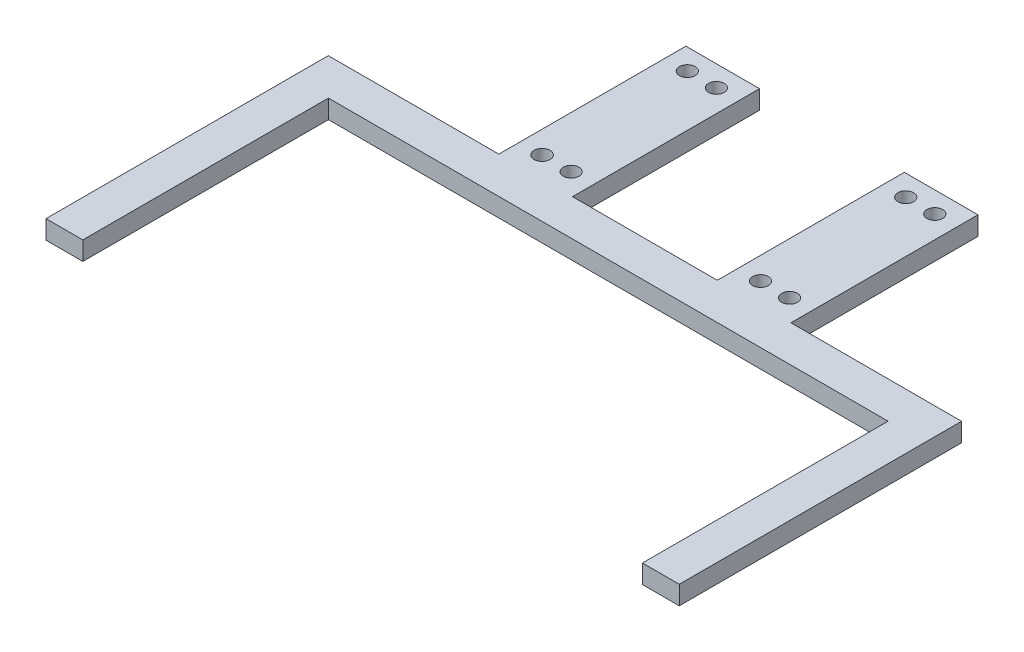
ISO-10303-21;
HEADER;
FILE_DESCRIPTION(('STEP AP214'),'2;1');
FILE_NAME('part.step','',(''),(''),'','','');
FILE_SCHEMA(('AUTOMOTIVE_DESIGN { 1 0 10303 214 1 1 1 1 }'));
ENDSEC;
DATA;
#1=APPLICATION_CONTEXT('core data for automotive mechanical design processes');
#2=APPLICATION_PROTOCOL_DEFINITION('international standard','automotive_design',2000,#1);
#3=PRODUCT_CONTEXT('',#1,'mechanical');
#4=PRODUCT('Part','Part','',(#3));
#5=PRODUCT_RELATED_PRODUCT_CATEGORY('part','',(#4));
#6=PRODUCT_DEFINITION_FORMATION('','',#4);
#7=PRODUCT_DEFINITION_CONTEXT('part definition',#1,'design');
#8=PRODUCT_DEFINITION('design','',#6,#7);
#9=PRODUCT_DEFINITION_SHAPE('','',#8);
#10=(LENGTH_UNIT() NAMED_UNIT(*) SI_UNIT(.MILLI.,.METRE.));
#11=(NAMED_UNIT(*) PLANE_ANGLE_UNIT() SI_UNIT($,.RADIAN.));
#12=(NAMED_UNIT(*) SI_UNIT($,.STERADIAN.) SOLID_ANGLE_UNIT());
#13=UNCERTAINTY_MEASURE_WITH_UNIT(LENGTH_MEASURE(1.E-05),#10,'distance_accuracy_value','');
#14=(GEOMETRIC_REPRESENTATION_CONTEXT(3) GLOBAL_UNCERTAINTY_ASSIGNED_CONTEXT((#13)) GLOBAL_UNIT_ASSIGNED_CONTEXT((#10,
#11,#12)) REPRESENTATION_CONTEXT('',''));
#15=CARTESIAN_POINT('',(0.,0.,0.));
#16=DIRECTION('',(0.,0.,1.));
#17=DIRECTION('',(1.,0.,0.));
#18=AXIS2_PLACEMENT_3D('',#15,#16,#17);
#19=CARTESIAN_POINT('',(19.2948975355751,6.35,-79.2235837449614));
#20=DIRECTION('',(0.,0.,1.));
#21=DIRECTION('',(1.,0.,0.));
#22=AXIS2_PLACEMENT_3D('',#19,#20,#21);
#23=PLANE('',#22);
#24=DIRECTION('',(-1.,0.,0.));
#25=VECTOR('',#24,1.);
#26=CARTESIAN_POINT('',(19.2948975355751,0.,-79.2235837449614));
#27=LINE('',#26,#25);
#28=CARTESIAN_POINT('',(77.2108975355751,0.,-79.2235837449614));
#29=VERTEX_POINT('',#28);
#30=CARTESIAN_POINT('',(19.2948975355751,0.,-79.2235837449614));
#31=VERTEX_POINT('',#30);
#32=EDGE_CURVE('E188',#29,#31,#27,.T.);
#33=ORIENTED_EDGE('',*,*,#32,.T.);
#34=DIRECTION('',(0.,-1.,0.));
#35=VECTOR('',#34,1.);
#36=CARTESIAN_POINT('',(19.2948975355751,6.35,-79.2235837449614));
#37=LINE('',#36,#35);
#38=CARTESIAN_POINT('',(19.2948975355751,6.35,-79.2235837449614));
#39=VERTEX_POINT('',#38);
#40=EDGE_CURVE('E11',#39,#31,#37,.T.);
#41=ORIENTED_EDGE('',*,*,#40,.F.);
#42=DIRECTION('',(-1.,0.,0.));
#43=VECTOR('',#42,1.);
#44=CARTESIAN_POINT('',(19.2948975355751,6.35,-79.2235837449614));
#45=LINE('',#44,#43);
#46=CARTESIAN_POINT('',(77.2108975355751,6.35,-79.2235837449614));
#47=VERTEX_POINT('',#46);
#48=EDGE_CURVE('E235',#47,#39,#45,.T.);
#49=ORIENTED_EDGE('',*,*,#48,.F.);
#50=DIRECTION('',(0.,-1.,0.));
#51=VECTOR('',#50,1.);
#52=CARTESIAN_POINT('',(77.2108975355751,6.35,-79.2235837449614));
#53=LINE('',#52,#51);
#54=EDGE_CURVE('E184',#47,#29,#53,.T.);
#55=ORIENTED_EDGE('',*,*,#54,.T.);
#56=EDGE_LOOP('',(#33,#41,#49,#55));
#57=FACE_BOUND('',#56,.T.);
#58=ADVANCED_FACE('F39',(#57),#23,.F.);
#59=CARTESIAN_POINT('',(19.2948975355752,6.35,16.6150405936629));
#60=DIRECTION('',(1.,0.,0.));
#61=DIRECTION('',(0.,0.,-1.));
#62=AXIS2_PLACEMENT_3D('',#59,#60,#61);
#63=PLANE('',#62);
#64=DIRECTION('',(0.,0.,1.));
#65=VECTOR('',#64,1.);
#66=CARTESIAN_POINT('',(19.2948975355752,0.,16.6150405936629));
#67=LINE('',#66,#65);
#68=CARTESIAN_POINT('',(19.2948975355752,0.,16.6150405936629));
#69=VERTEX_POINT('',#68);
#70=EDGE_CURVE('E192',#31,#69,#67,.T.);
#71=ORIENTED_EDGE('',*,*,#70,.T.);
#72=DIRECTION('',(0.,-1.,0.));
#73=VECTOR('',#72,1.);
#74=CARTESIAN_POINT('',(19.2948975355752,6.35,16.6150405936629));
#75=LINE('',#74,#73);
#76=CARTESIAN_POINT('',(19.2948975355752,6.35,16.6150405936629));
#77=VERTEX_POINT('',#76);
#78=EDGE_CURVE('E48',#77,#69,#75,.T.);
#79=ORIENTED_EDGE('',*,*,#78,.F.);
#80=DIRECTION('',(0.,0.,1.));
#81=VECTOR('',#80,1.);
#82=CARTESIAN_POINT('',(19.2948975355752,6.35,16.6150405936629));
#83=LINE('',#82,#81);
#84=EDGE_CURVE('E123',#39,#77,#83,.T.);
#85=ORIENTED_EDGE('',*,*,#84,.F.);
#86=ORIENTED_EDGE('',*,*,#40,.T.);
#87=EDGE_LOOP('',(#71,#79,#85,#86));
#88=FACE_BOUND('',#87,.T.);
#89=ADVANCED_FACE('F358',(#88),#63,.F.);
#90=CARTESIAN_POINT('',(31.7948975355752,6.35,16.6150405936629));
#91=DIRECTION('',(0.,0.,-1.));
#92=DIRECTION('',(-1.,0.,0.));
#93=AXIS2_PLACEMENT_3D('',#90,#91,#92);
#94=PLANE('',#93);
#95=DIRECTION('',(1.,0.,0.));
#96=VECTOR('',#95,1.);
#97=CARTESIAN_POINT('',(31.7948975355752,0.,16.6150405936629));
#98=LINE('',#97,#96);
#99=CARTESIAN_POINT('',(31.7948975355752,0.,16.6150405936629));
#100=VERTEX_POINT('',#99);
#101=EDGE_CURVE('E196',#69,#100,#98,.T.);
#102=ORIENTED_EDGE('',*,*,#101,.T.);
#103=DIRECTION('',(0.,-1.,0.));
#104=VECTOR('',#103,1.);
#105=CARTESIAN_POINT('',(31.7948975355752,6.35,16.6150405936629));
#106=LINE('',#105,#104);
#107=CARTESIAN_POINT('',(31.7948975355752,6.35,16.6150405936629));
#108=VERTEX_POINT('',#107);
#109=EDGE_CURVE('E278',#108,#100,#106,.T.);
#110=ORIENTED_EDGE('',*,*,#109,.F.);
#111=DIRECTION('',(1.,0.,0.));
#112=VECTOR('',#111,1.);
#113=CARTESIAN_POINT('',(31.7948975355752,6.35,16.6150405936629));
#114=LINE('',#113,#112);
#115=EDGE_CURVE('E288',#77,#108,#114,.T.);
#116=ORIENTED_EDGE('',*,*,#115,.F.);
#117=ORIENTED_EDGE('',*,*,#78,.T.);
#118=EDGE_LOOP('',(#102,#110,#116,#117));
#119=FACE_BOUND('',#118,.T.);
#120=ADVANCED_FACE('F286',(#119),#94,.F.);
#121=CARTESIAN_POINT('',(31.7948975355751,6.35,-66.7775837449614));
#122=DIRECTION('',(-1.,0.,0.));
#123=DIRECTION('',(0.,0.,1.));
#124=AXIS2_PLACEMENT_3D('',#121,#122,#123);
#125=PLANE('',#124);
#126=DIRECTION('',(0.,0.,-1.));
#127=VECTOR('',#126,1.);
#128=CARTESIAN_POINT('',(31.7948975355751,0.,-66.7775837449614));
#129=LINE('',#128,#127);
#130=CARTESIAN_POINT('',(31.7948975355751,0.,-66.7775837449614));
#131=VERTEX_POINT('',#130);
#132=EDGE_CURVE('E199',#100,#131,#129,.T.);
#133=ORIENTED_EDGE('',*,*,#132,.T.);
#134=DIRECTION('',(0.,-1.,0.));
#135=VECTOR('',#134,1.);
#136=CARTESIAN_POINT('',(31.7948975355751,6.35,-66.7775837449614));
#137=LINE('',#136,#135);
#138=CARTESIAN_POINT('',(31.7948975355751,6.35,-66.7775837449614));
#139=VERTEX_POINT('',#138);
#140=EDGE_CURVE('E274',#139,#131,#137,.T.);
#141=ORIENTED_EDGE('',*,*,#140,.F.);
#142=DIRECTION('',(0.,0.,-1.));
#143=VECTOR('',#142,1.);
#144=CARTESIAN_POINT('',(31.7948975355751,6.35,-66.7775837449614));
#145=LINE('',#144,#143);
#146=EDGE_CURVE('E307',#108,#139,#145,.T.);
#147=ORIENTED_EDGE('',*,*,#146,.F.);
#148=ORIENTED_EDGE('',*,*,#109,.T.);
#149=EDGE_LOOP('',(#133,#141,#147,#148));
#150=FACE_BOUND('',#149,.T.);
#151=ADVANCED_FACE('F297',(#150),#125,.F.);
#152=CARTESIAN_POINT('',(221.794897535575,6.35,-66.7775837449614));
#153=DIRECTION('',(0.,0.,-1.));
#154=DIRECTION('',(-1.,0.,0.));
#155=AXIS2_PLACEMENT_3D('',#152,#153,#154);
#156=PLANE('',#155);
#157=DIRECTION('',(1.,0.,0.));
#158=VECTOR('',#157,1.);
#159=CARTESIAN_POINT('',(221.794897535575,0.,-66.7775837449614));
#160=LINE('',#159,#158);
#161=CARTESIAN_POINT('',(221.794897535575,0.,-66.7775837449614));
#162=VERTEX_POINT('',#161);
#163=EDGE_CURVE('E202',#131,#162,#160,.T.);
#164=ORIENTED_EDGE('',*,*,#163,.T.);
#165=DIRECTION('',(0.,-1.,0.));
#166=VECTOR('',#165,1.);
#167=CARTESIAN_POINT('',(221.794897535575,6.35,-66.7775837449614));
#168=LINE('',#167,#166);
#169=CARTESIAN_POINT('',(221.794897535575,6.35,-66.7775837449614));
#170=VERTEX_POINT('',#169);
#171=EDGE_CURVE('E270',#170,#162,#168,.T.);
#172=ORIENTED_EDGE('',*,*,#171,.F.);
#173=DIRECTION('',(1.,0.,0.));
#174=VECTOR('',#173,1.);
#175=CARTESIAN_POINT('',(221.794897535575,6.35,-66.7775837449614));
#176=LINE('',#175,#174);
#177=EDGE_CURVE('E303',#139,#170,#176,.T.);
#178=ORIENTED_EDGE('',*,*,#177,.F.);
#179=ORIENTED_EDGE('',*,*,#140,.T.);
#180=EDGE_LOOP('',(#164,#172,#178,#179));
#181=FACE_BOUND('',#180,.T.);
#182=ADVANCED_FACE('F301',(#181),#156,.F.);
#183=CARTESIAN_POINT('',(221.794897535575,6.35,16.6150405936629));
#184=DIRECTION('',(1.,0.,0.));
#185=DIRECTION('',(0.,0.,-1.));
#186=AXIS2_PLACEMENT_3D('',#183,#184,#185);
#187=PLANE('',#186);
#188=DIRECTION('',(0.,0.,1.));
#189=VECTOR('',#188,1.);
#190=CARTESIAN_POINT('',(221.794897535575,0.,16.6150405936629));
#191=LINE('',#190,#189);
#192=CARTESIAN_POINT('',(221.794897535575,0.,16.6150405936629));
#193=VERTEX_POINT('',#192);
#194=EDGE_CURVE('E205',#162,#193,#191,.T.);
#195=ORIENTED_EDGE('',*,*,#194,.T.);
#196=DIRECTION('',(0.,-1.,0.));
#197=VECTOR('',#196,1.);
#198=CARTESIAN_POINT('',(221.794897535575,6.35,16.6150405936629));
#199=LINE('',#198,#197);
#200=CARTESIAN_POINT('',(221.794897535575,6.35,16.6150405936629));
#201=VERTEX_POINT('',#200);
#202=EDGE_CURVE('E266',#201,#193,#199,.T.);
#203=ORIENTED_EDGE('',*,*,#202,.F.);
#204=DIRECTION('',(0.,0.,1.));
#205=VECTOR('',#204,1.);
#206=CARTESIAN_POINT('',(221.794897535575,6.35,16.6150405936629));
#207=LINE('',#206,#205);
#208=EDGE_CURVE('E306',#170,#201,#207,.T.);
#209=ORIENTED_EDGE('',*,*,#208,.F.);
#210=ORIENTED_EDGE('',*,*,#171,.T.);
#211=EDGE_LOOP('',(#195,#203,#209,#210));
#212=FACE_BOUND('',#211,.T.);
#213=ADVANCED_FACE('F371',(#212),#187,.F.);
#214=CARTESIAN_POINT('',(234.294897535575,6.35,16.6150405936629));
#215=DIRECTION('',(0.,0.,-1.));
#216=DIRECTION('',(-1.,0.,0.));
#217=AXIS2_PLACEMENT_3D('',#214,#215,#216);
#218=PLANE('',#217);
#219=DIRECTION('',(1.,0.,0.));
#220=VECTOR('',#219,1.);
#221=CARTESIAN_POINT('',(234.294897535575,0.,16.6150405936629));
#222=LINE('',#221,#220);
#223=CARTESIAN_POINT('',(234.294897535575,0.,16.6150405936629));
#224=VERTEX_POINT('',#223);
#225=EDGE_CURVE('E208',#193,#224,#222,.T.);
#226=ORIENTED_EDGE('',*,*,#225,.T.);
#227=DIRECTION('',(0.,-1.,0.));
#228=VECTOR('',#227,1.);
#229=CARTESIAN_POINT('',(234.294897535575,6.35,16.6150405936629));
#230=LINE('',#229,#228);
#231=CARTESIAN_POINT('',(234.294897535575,6.35,16.6150405936629));
#232=VERTEX_POINT('',#231);
#233=EDGE_CURVE('E262',#232,#224,#230,.T.);
#234=ORIENTED_EDGE('',*,*,#233,.F.);
#235=DIRECTION('',(1.,0.,0.));
#236=VECTOR('',#235,1.);
#237=CARTESIAN_POINT('',(234.294897535575,6.35,16.6150405936629));
#238=LINE('',#237,#236);
#239=EDGE_CURVE('E311',#201,#232,#238,.T.);
#240=ORIENTED_EDGE('',*,*,#239,.F.);
#241=ORIENTED_EDGE('',*,*,#202,.T.);
#242=EDGE_LOOP('',(#226,#234,#240,#241));
#243=FACE_BOUND('',#242,.T.);
#244=ADVANCED_FACE('F374',(#243),#218,.F.);
#245=CARTESIAN_POINT('',(234.294897535575,6.35,-79.2235837449614));
#246=DIRECTION('',(-1.,0.,0.));
#247=DIRECTION('',(0.,0.,1.));
#248=AXIS2_PLACEMENT_3D('',#245,#246,#247);
#249=PLANE('',#248);
#250=DIRECTION('',(0.,0.,-1.));
#251=VECTOR('',#250,1.);
#252=CARTESIAN_POINT('',(234.294897535575,0.,-79.2235837449614));
#253=LINE('',#252,#251);
#254=CARTESIAN_POINT('',(234.294897535575,0.,-79.2235837449614));
#255=VERTEX_POINT('',#254);
#256=EDGE_CURVE('E211',#224,#255,#253,.T.);
#257=ORIENTED_EDGE('',*,*,#256,.T.);
#258=DIRECTION('',(0.,-1.,0.));
#259=VECTOR('',#258,1.);
#260=CARTESIAN_POINT('',(234.294897535575,6.35,-79.2235837449614));
#261=LINE('',#260,#259);
#262=CARTESIAN_POINT('',(234.294897535575,6.35,-79.2235837449614));
#263=VERTEX_POINT('',#262);
#264=EDGE_CURVE('E258',#263,#255,#261,.T.);
#265=ORIENTED_EDGE('',*,*,#264,.F.);
#266=DIRECTION('',(0.,0.,-1.));
#267=VECTOR('',#266,1.);
#268=CARTESIAN_POINT('',(234.294897535575,6.35,-79.2235837449614));
#269=LINE('',#268,#267);
#270=EDGE_CURVE('E318',#232,#263,#269,.T.);
#271=ORIENTED_EDGE('',*,*,#270,.F.);
#272=ORIENTED_EDGE('',*,*,#233,.T.);
#273=EDGE_LOOP('',(#257,#265,#271,#272));
#274=FACE_BOUND('',#273,.T.);
#275=ADVANCED_FACE('F378',(#274),#249,.F.);
#276=CARTESIAN_POINT('',(176.378897535575,6.35,-79.2235837449614));
#277=DIRECTION('',(0.,0.,1.));
#278=DIRECTION('',(1.,0.,0.));
#279=AXIS2_PLACEMENT_3D('',#276,#277,#278);
#280=PLANE('',#279);
#281=DIRECTION('',(-1.,0.,0.));
#282=VECTOR('',#281,1.);
#283=CARTESIAN_POINT('',(176.378897535575,0.,-79.2235837449614));
#284=LINE('',#283,#282);
#285=CARTESIAN_POINT('',(176.378897535575,0.,-79.2235837449614));
#286=VERTEX_POINT('',#285);
#287=EDGE_CURVE('E214',#255,#286,#284,.T.);
#288=ORIENTED_EDGE('',*,*,#287,.T.);
#289=DIRECTION('',(0.,-1.,0.));
#290=VECTOR('',#289,1.);
#291=CARTESIAN_POINT('',(176.378897535575,6.35,-79.2235837449614));
#292=LINE('',#291,#290);
#293=CARTESIAN_POINT('',(176.378897535575,6.35,-79.2235837449614));
#294=VERTEX_POINT('',#293);
#295=EDGE_CURVE('E254',#294,#286,#292,.T.);
#296=ORIENTED_EDGE('',*,*,#295,.F.);
#297=DIRECTION('',(-1.,0.,0.));
#298=VECTOR('',#297,1.);
#299=CARTESIAN_POINT('',(176.378897535575,6.35,-79.2235837449614));
#300=LINE('',#299,#298);
#301=EDGE_CURVE('E321',#263,#294,#300,.T.);
#302=ORIENTED_EDGE('',*,*,#301,.F.);
#303=ORIENTED_EDGE('',*,*,#264,.T.);
#304=EDGE_LOOP('',(#288,#296,#302,#303));
#305=FACE_BOUND('',#304,.T.);
#306=ADVANCED_FACE('F382',(#305),#280,.F.);
#307=CARTESIAN_POINT('',(176.378897535575,6.35,-142.723583744961));
#308=DIRECTION('',(-1.,0.,0.));
#309=DIRECTION('',(0.,0.,1.));
#310=AXIS2_PLACEMENT_3D('',#307,#308,#309);
#311=PLANE('',#310);
#312=DIRECTION('',(0.,0.,-1.));
#313=VECTOR('',#312,1.);
#314=CARTESIAN_POINT('',(176.378897535575,0.,-142.723583744961));
#315=LINE('',#314,#313);
#316=CARTESIAN_POINT('',(176.378897535575,0.,-142.723583744961));
#317=VERTEX_POINT('',#316);
#318=EDGE_CURVE('E217',#286,#317,#315,.T.);
#319=ORIENTED_EDGE('',*,*,#318,.T.);
#320=DIRECTION('',(0.,-1.,0.));
#321=VECTOR('',#320,1.);
#322=CARTESIAN_POINT('',(176.378897535575,6.35,-142.723583744961));
#323=LINE('',#322,#321);
#324=CARTESIAN_POINT('',(176.378897535575,6.35,-142.723583744961));
#325=VERTEX_POINT('',#324);
#326=EDGE_CURVE('E250',#325,#317,#323,.T.);
#327=ORIENTED_EDGE('',*,*,#326,.F.);
#328=DIRECTION('',(0.,0.,-1.));
#329=VECTOR('',#328,1.);
#330=CARTESIAN_POINT('',(176.378897535575,6.35,-142.723583744961));
#331=LINE('',#330,#329);
#332=EDGE_CURVE('E324',#294,#325,#331,.T.);
#333=ORIENTED_EDGE('',*,*,#332,.F.);
#334=ORIENTED_EDGE('',*,*,#295,.T.);
#335=EDGE_LOOP('',(#319,#327,#333,#334));
#336=FACE_BOUND('',#335,.T.);
#337=ADVANCED_FACE('F386',(#336),#311,.F.);
#338=CARTESIAN_POINT('',(151.378897535575,6.35,-142.723583744961));
#339=DIRECTION('',(0.,0.,1.));
#340=DIRECTION('',(1.,0.,0.));
#341=AXIS2_PLACEMENT_3D('',#338,#339,#340);
#342=PLANE('',#341);
#343=DIRECTION('',(-1.,0.,0.));
#344=VECTOR('',#343,1.);
#345=CARTESIAN_POINT('',(151.378897535575,0.,-142.723583744961));
#346=LINE('',#345,#344);
#347=CARTESIAN_POINT('',(151.378897535575,0.,-142.723583744961));
#348=VERTEX_POINT('',#347);
#349=EDGE_CURVE('E220',#317,#348,#346,.T.);
#350=ORIENTED_EDGE('',*,*,#349,.T.);
#351=DIRECTION('',(0.,-1.,0.));
#352=VECTOR('',#351,1.);
#353=CARTESIAN_POINT('',(151.378897535575,6.35,-142.723583744961));
#354=LINE('',#353,#352);
#355=CARTESIAN_POINT('',(151.378897535575,6.35,-142.723583744961));
#356=VERTEX_POINT('',#355);
#357=EDGE_CURVE('E246',#356,#348,#354,.T.);
#358=ORIENTED_EDGE('',*,*,#357,.F.);
#359=DIRECTION('',(-1.,0.,0.));
#360=VECTOR('',#359,1.);
#361=CARTESIAN_POINT('',(151.378897535575,6.35,-142.723583744961));
#362=LINE('',#361,#360);
#363=EDGE_CURVE('E327',#325,#356,#362,.T.);
#364=ORIENTED_EDGE('',*,*,#363,.F.);
#365=ORIENTED_EDGE('',*,*,#326,.T.);
#366=EDGE_LOOP('',(#350,#358,#364,#365));
#367=FACE_BOUND('',#366,.T.);
#368=ADVANCED_FACE('F390',(#367),#342,.F.);
#369=CARTESIAN_POINT('',(151.378897535575,6.35,-79.2235837449614));
#370=DIRECTION('',(1.,0.,0.));
#371=DIRECTION('',(0.,0.,-1.));
#372=AXIS2_PLACEMENT_3D('',#369,#370,#371);
#373=PLANE('',#372);
#374=DIRECTION('',(0.,0.,1.));
#375=VECTOR('',#374,1.);
#376=CARTESIAN_POINT('',(151.378897535575,0.,-79.2235837449614));
#377=LINE('',#376,#375);
#378=CARTESIAN_POINT('',(151.378897535575,0.,-79.2235837449614));
#379=VERTEX_POINT('',#378);
#380=EDGE_CURVE('E223',#348,#379,#377,.T.);
#381=ORIENTED_EDGE('',*,*,#380,.T.);
#382=DIRECTION('',(0.,-1.,0.));
#383=VECTOR('',#382,1.);
#384=CARTESIAN_POINT('',(151.378897535575,6.35,-79.2235837449614));
#385=LINE('',#384,#383);
#386=CARTESIAN_POINT('',(151.378897535575,6.35,-79.2235837449614));
#387=VERTEX_POINT('',#386);
#388=EDGE_CURVE('E242',#387,#379,#385,.T.);
#389=ORIENTED_EDGE('',*,*,#388,.F.);
#390=DIRECTION('',(0.,0.,1.));
#391=VECTOR('',#390,1.);
#392=CARTESIAN_POINT('',(151.378897535575,6.35,-79.2235837449614));
#393=LINE('',#392,#391);
#394=EDGE_CURVE('E330',#356,#387,#393,.T.);
#395=ORIENTED_EDGE('',*,*,#394,.F.);
#396=ORIENTED_EDGE('',*,*,#357,.T.);
#397=EDGE_LOOP('',(#381,#389,#395,#396));
#398=FACE_BOUND('',#397,.T.);
#399=ADVANCED_FACE('F338',(#398),#373,.F.);
#400=CARTESIAN_POINT('',(102.210897535575,6.35,-79.2235837449614));
#401=DIRECTION('',(0.,0.,1.));
#402=DIRECTION('',(1.,0.,0.));
#403=AXIS2_PLACEMENT_3D('',#400,#401,#402);
#404=PLANE('',#403);
#405=DIRECTION('',(-1.,0.,0.));
#406=VECTOR('',#405,1.);
#407=CARTESIAN_POINT('',(102.210897535575,0.,-79.2235837449614));
#408=LINE('',#407,#406);
#409=CARTESIAN_POINT('',(102.210897535575,0.,-79.2235837449614));
#410=VERTEX_POINT('',#409);
#411=EDGE_CURVE('E226',#379,#410,#408,.T.);
#412=ORIENTED_EDGE('',*,*,#411,.T.);
#413=DIRECTION('',(0.,-1.,0.));
#414=VECTOR('',#413,1.);
#415=CARTESIAN_POINT('',(102.210897535575,6.35,-79.2235837449614));
#416=LINE('',#415,#414);
#417=CARTESIAN_POINT('',(102.210897535575,6.35,-79.2235837449614));
#418=VERTEX_POINT('',#417);
#419=EDGE_CURVE('E177',#418,#410,#416,.T.);
#420=ORIENTED_EDGE('',*,*,#419,.F.);
#421=DIRECTION('',(-1.,0.,0.));
#422=VECTOR('',#421,1.);
#423=CARTESIAN_POINT('',(102.210897535575,6.35,-79.2235837449614));
#424=LINE('',#423,#422);
#425=EDGE_CURVE('E166',#387,#418,#424,.T.);
#426=ORIENTED_EDGE('',*,*,#425,.F.);
#427=ORIENTED_EDGE('',*,*,#388,.T.);
#428=EDGE_LOOP('',(#412,#420,#426,#427));
#429=FACE_BOUND('',#428,.T.);
#430=ADVANCED_FACE('F342',(#429),#404,.F.);
#431=CARTESIAN_POINT('',(102.210897535575,6.35,-142.723583744961));
#432=DIRECTION('',(-1.,0.,0.));
#433=DIRECTION('',(0.,0.,1.));
#434=AXIS2_PLACEMENT_3D('',#431,#432,#433);
#435=PLANE('',#434);
#436=DIRECTION('',(0.,0.,-1.));
#437=VECTOR('',#436,1.);
#438=CARTESIAN_POINT('',(102.210897535575,0.,-142.723583744961));
#439=LINE('',#438,#437);
#440=CARTESIAN_POINT('',(102.210897535575,0.,-142.723583744961));
#441=VERTEX_POINT('',#440);
#442=EDGE_CURVE('E175',#410,#441,#439,.T.);
#443=ORIENTED_EDGE('',*,*,#442,.T.);
#444=DIRECTION('',(0.,-1.,0.));
#445=VECTOR('',#444,1.);
#446=CARTESIAN_POINT('',(102.210897535575,6.35,-142.723583744961));
#447=LINE('',#446,#445);
#448=CARTESIAN_POINT('',(102.210897535575,6.35,-142.723583744961));
#449=VERTEX_POINT('',#448);
#450=EDGE_CURVE('E172',#449,#441,#447,.T.);
#451=ORIENTED_EDGE('',*,*,#450,.F.);
#452=DIRECTION('',(0.,0.,-1.));
#453=VECTOR('',#452,1.);
#454=CARTESIAN_POINT('',(102.210897535575,6.35,-142.723583744961));
#455=LINE('',#454,#453);
#456=EDGE_CURVE('E160',#418,#449,#455,.T.);
#457=ORIENTED_EDGE('',*,*,#456,.F.);
#458=ORIENTED_EDGE('',*,*,#419,.T.);
#459=EDGE_LOOP('',(#443,#451,#457,#458));
#460=FACE_BOUND('',#459,.T.);
#461=ADVANCED_FACE('F173',(#460),#435,.F.);
#462=CARTESIAN_POINT('',(77.2108975355752,6.35,-142.723583744961));
#463=DIRECTION('',(0.,0.,1.));
#464=DIRECTION('',(1.,0.,0.));
#465=AXIS2_PLACEMENT_3D('',#462,#463,#464);
#466=PLANE('',#465);
#467=DIRECTION('',(-1.,0.,0.));
#468=VECTOR('',#467,1.);
#469=CARTESIAN_POINT('',(77.2108975355752,0.,-142.723583744961));
#470=LINE('',#469,#468);
#471=CARTESIAN_POINT('',(77.2108975355752,0.,-142.723583744961));
#472=VERTEX_POINT('',#471);
#473=EDGE_CURVE('E109',#441,#472,#470,.T.);
#474=ORIENTED_EDGE('',*,*,#473,.T.);
#475=DIRECTION('',(0.,-1.,0.));
#476=VECTOR('',#475,1.);
#477=CARTESIAN_POINT('',(77.2108975355752,6.35,-142.723583744961));
#478=LINE('',#477,#476);
#479=CARTESIAN_POINT('',(77.2108975355752,6.35,-142.723583744961));
#480=VERTEX_POINT('',#479);
#481=EDGE_CURVE('E178',#480,#472,#478,.T.);
#482=ORIENTED_EDGE('',*,*,#481,.F.);
#483=DIRECTION('',(-1.,0.,0.));
#484=VECTOR('',#483,1.);
#485=CARTESIAN_POINT('',(77.2108975355752,6.35,-142.723583744961));
#486=LINE('',#485,#484);
#487=EDGE_CURVE('E164',#449,#480,#486,.T.);
#488=ORIENTED_EDGE('',*,*,#487,.F.);
#489=ORIENTED_EDGE('',*,*,#450,.T.);
#490=EDGE_LOOP('',(#474,#482,#488,#489));
#491=FACE_BOUND('',#490,.T.);
#492=ADVANCED_FACE('F180',(#491),#466,.F.);
#493=CARTESIAN_POINT('',(77.2108975355751,6.35,-79.2235837449614));
#494=DIRECTION('',(1.,0.,0.));
#495=DIRECTION('',(0.,0.,-1.));
#496=AXIS2_PLACEMENT_3D('',#493,#494,#495);
#497=PLANE('',#496);
#498=DIRECTION('',(0.,0.,1.));
#499=VECTOR('',#498,1.);
#500=CARTESIAN_POINT('',(77.2108975355751,0.,-79.2235837449614));
#501=LINE('',#500,#499);
#502=EDGE_CURVE('E115',#472,#29,#501,.T.);
#503=ORIENTED_EDGE('',*,*,#502,.T.);
#504=ORIENTED_EDGE('',*,*,#54,.F.);
#505=DIRECTION('',(0.,0.,1.));
#506=VECTOR('',#505,1.);
#507=CARTESIAN_POINT('',(77.2108975355751,6.35,-79.2235837449614));
#508=LINE('',#507,#506);
#509=EDGE_CURVE('E56',#480,#47,#508,.T.);
#510=ORIENTED_EDGE('',*,*,#509,.F.);
#511=ORIENTED_EDGE('',*,*,#481,.T.);
#512=EDGE_LOOP('',(#503,#504,#510,#511));
#513=FACE_BOUND('',#512,.T.);
#514=ADVANCED_FACE('F346',(#513),#497,.F.);
#515=CARTESIAN_POINT('',(0.,6.35,0.));
#516=DIRECTION('',(0.,1.,0.));
#517=DIRECTION('',(0.,0.,1.));
#518=AXIS2_PLACEMENT_3D('',#515,#516,#517);
#519=PLANE('',#518);
#520=CARTESIAN_POINT('',(158.939897535575,6.35,-86.3235837449614));
#521=DIRECTION('',(0.,1.,0.));
#522=DIRECTION('',(0.,0.,1.));
#523=AXIS2_PLACEMENT_3D('',#520,#521,#522);
#524=CIRCLE('',#523,2.66300000000001);
#525=CARTESIAN_POINT('',(158.939897535575,6.35,-83.6605837449613));
#526=VERTEX_POINT('',#525);
#527=EDGE_CURVE('E516',#526,#526,#524,.F.);
#528=ORIENTED_EDGE('',*,*,#527,.T.);
#529=EDGE_LOOP('',(#528));
#530=FACE_BOUND('',#529,.T.);
#531=CARTESIAN_POINT('',(94.6498975354991,6.35,-135.623583744961));
#532=DIRECTION('',(0.,1.,0.));
#533=DIRECTION('',(0.,0.,1.));
#534=AXIS2_PLACEMENT_3D('',#531,#532,#533);
#535=CIRCLE('',#534,2.663);
#536=CARTESIAN_POINT('',(94.6498975354991,6.35,-132.960583744961));
#537=VERTEX_POINT('',#536);
#538=EDGE_CURVE('E523',#537,#537,#535,.F.);
#539=ORIENTED_EDGE('',*,*,#538,.T.);
#540=EDGE_LOOP('',(#539));
#541=FACE_BOUND('',#540,.T.);
#542=CARTESIAN_POINT('',(84.7798975354991,6.35,-135.623583744961));
#543=DIRECTION('',(0.,1.,0.));
#544=DIRECTION('',(0.,0.,1.));
#545=AXIS2_PLACEMENT_3D('',#542,#543,#544);
#546=CIRCLE('',#545,2.663);
#547=CARTESIAN_POINT('',(84.7798975354991,6.35,-132.960583744961));
#548=VERTEX_POINT('',#547);
#549=EDGE_CURVE('E534',#548,#548,#546,.F.);
#550=ORIENTED_EDGE('',*,*,#549,.T.);
#551=EDGE_LOOP('',(#550));
#552=FACE_BOUND('',#551,.T.);
#553=CARTESIAN_POINT('',(94.6498975354991,6.35,-86.3235837449614));
#554=DIRECTION('',(0.,1.,0.));
#555=DIRECTION('',(0.,0.,1.));
#556=AXIS2_PLACEMENT_3D('',#553,#554,#555);
#557=CIRCLE('',#556,2.66299999999999);
#558=CARTESIAN_POINT('',(94.6498975354991,6.35,-83.6605837449614));
#559=VERTEX_POINT('',#558);
#560=EDGE_CURVE('E533',#559,#559,#557,.F.);
#561=ORIENTED_EDGE('',*,*,#560,.T.);
#562=EDGE_LOOP('',(#561));
#563=FACE_BOUND('',#562,.T.);
#564=CARTESIAN_POINT('',(168.809897535575,6.35,-135.623583744961));
#565=DIRECTION('',(0.,1.,0.));
#566=DIRECTION('',(0.,0.,1.));
#567=AXIS2_PLACEMENT_3D('',#564,#565,#566);
#568=CIRCLE('',#567,2.66300000000001);
#569=CARTESIAN_POINT('',(168.809897535575,6.35,-132.960583744961));
#570=VERTEX_POINT('',#569);
#571=EDGE_CURVE('E570',#570,#570,#568,.F.);
#572=ORIENTED_EDGE('',*,*,#571,.T.);
#573=EDGE_LOOP('',(#572));
#574=FACE_BOUND('',#573,.T.);
#575=CARTESIAN_POINT('',(158.939897535575,6.35,-135.623583744961));
#576=DIRECTION('',(0.,1.,0.));
#577=DIRECTION('',(0.,0.,1.));
#578=AXIS2_PLACEMENT_3D('',#575,#576,#577);
#579=CIRCLE('',#578,2.66300000000001);
#580=CARTESIAN_POINT('',(158.939897535575,6.35,-132.960583744961));
#581=VERTEX_POINT('',#580);
#582=EDGE_CURVE('E561',#581,#581,#579,.F.);
#583=ORIENTED_EDGE('',*,*,#582,.T.);
#584=EDGE_LOOP('',(#583));
#585=FACE_BOUND('',#584,.T.);
#586=CARTESIAN_POINT('',(168.809897535575,6.35,-86.3235837449614));
#587=DIRECTION('',(0.,1.,0.));
#588=DIRECTION('',(0.,0.,1.));
#589=AXIS2_PLACEMENT_3D('',#586,#587,#588);
#590=CIRCLE('',#589,2.66300000000001);
#591=CARTESIAN_POINT('',(168.809897535575,6.35,-83.6605837449613));
#592=VERTEX_POINT('',#591);
#593=EDGE_CURVE('E525',#592,#592,#590,.F.);
#594=ORIENTED_EDGE('',*,*,#593,.T.);
#595=EDGE_LOOP('',(#594));
#596=FACE_BOUND('',#595,.T.);
#597=CARTESIAN_POINT('',(84.7798975354991,6.35,-86.3235837449614));
#598=DIRECTION('',(0.,1.,0.));
#599=DIRECTION('',(0.,0.,1.));
#600=AXIS2_PLACEMENT_3D('',#597,#598,#599);
#601=CIRCLE('',#600,2.71300002700001);
#602=CARTESIAN_POINT('',(84.7798975354991,6.35,-83.6105837179613));
#603=VERTEX_POINT('',#602);
#604=EDGE_CURVE('E193',#603,#603,#601,.F.);
#605=ORIENTED_EDGE('',*,*,#604,.T.);
#606=EDGE_LOOP('',(#605));
#607=FACE_BOUND('',#606,.T.);
#608=ORIENTED_EDGE('',*,*,#48,.T.);
#609=ORIENTED_EDGE('',*,*,#84,.T.);
#610=ORIENTED_EDGE('',*,*,#115,.T.);
#611=ORIENTED_EDGE('',*,*,#146,.T.);
#612=ORIENTED_EDGE('',*,*,#177,.T.);
#613=ORIENTED_EDGE('',*,*,#208,.T.);
#614=ORIENTED_EDGE('',*,*,#239,.T.);
#615=ORIENTED_EDGE('',*,*,#270,.T.);
#616=ORIENTED_EDGE('',*,*,#301,.T.);
#617=ORIENTED_EDGE('',*,*,#332,.T.);
#618=ORIENTED_EDGE('',*,*,#363,.T.);
#619=ORIENTED_EDGE('',*,*,#394,.T.);
#620=ORIENTED_EDGE('',*,*,#425,.T.);
#621=ORIENTED_EDGE('',*,*,#456,.T.);
#622=ORIENTED_EDGE('',*,*,#487,.T.);
#623=ORIENTED_EDGE('',*,*,#509,.T.);
#624=EDGE_LOOP('',(#608,#609,#610,#611,#612,#613,#614,#615,#616,#617,#618,#619,#620,#621,#622,#623));
#625=FACE_BOUND('',#624,.T.);
#626=ADVANCED_FACE('F162',(#530,#541,#552,#563,#574,#585,#596,#607,#625),#519,.T.);
#627=CARTESIAN_POINT('',(0.,0.,0.));
#628=DIRECTION('',(0.,1.,0.));
#629=DIRECTION('',(0.,0.,1.));
#630=AXIS2_PLACEMENT_3D('',#627,#628,#629);
#631=PLANE('',#630);
#632=CARTESIAN_POINT('',(158.939897535575,0.,-86.3235837449614));
#633=DIRECTION('',(0.,-1.,0.));
#634=DIRECTION('',(0.,0.,-1.));
#635=AXIS2_PLACEMENT_3D('',#632,#633,#634);
#636=CIRCLE('',#635,2.66300000000001);
#637=CARTESIAN_POINT('',(158.939897535575,0.,-88.9865837449614));
#638=VERTEX_POINT('',#637);
#639=EDGE_CURVE('E513',#638,#638,#636,.T.);
#640=ORIENTED_EDGE('',*,*,#639,.F.);
#641=EDGE_LOOP('',(#640));
#642=FACE_BOUND('',#641,.T.);
#643=CARTESIAN_POINT('',(94.6498975354991,0.,-135.623583744961));
#644=DIRECTION('',(0.,-1.,0.));
#645=DIRECTION('',(0.,0.,-1.));
#646=AXIS2_PLACEMENT_3D('',#643,#644,#645);
#647=CIRCLE('',#646,2.663);
#648=CARTESIAN_POINT('',(94.6498975354991,0.,-138.286583744961));
#649=VERTEX_POINT('',#648);
#650=EDGE_CURVE('E518',#649,#649,#647,.T.);
#651=ORIENTED_EDGE('',*,*,#650,.F.);
#652=EDGE_LOOP('',(#651));
#653=FACE_BOUND('',#652,.T.);
#654=CARTESIAN_POINT('',(84.7798975354991,0.,-135.623583744961));
#655=DIRECTION('',(0.,-1.,0.));
#656=DIRECTION('',(0.,0.,-1.));
#657=AXIS2_PLACEMENT_3D('',#654,#655,#656);
#658=CIRCLE('',#657,2.663);
#659=CARTESIAN_POINT('',(84.7798975354991,0.,-138.286583744961));
#660=VERTEX_POINT('',#659);
#661=EDGE_CURVE('E539',#660,#660,#658,.T.);
#662=ORIENTED_EDGE('',*,*,#661,.F.);
#663=EDGE_LOOP('',(#662));
#664=FACE_BOUND('',#663,.T.);
#665=CARTESIAN_POINT('',(94.6498975354991,0.,-86.3235837449614));
#666=DIRECTION('',(0.,-1.,0.));
#667=DIRECTION('',(0.,0.,-1.));
#668=AXIS2_PLACEMENT_3D('',#665,#666,#667);
#669=CIRCLE('',#668,2.66299999999999);
#670=CARTESIAN_POINT('',(94.6498975354991,0.,-88.9865837449614));
#671=VERTEX_POINT('',#670);
#672=EDGE_CURVE('E529',#671,#671,#669,.T.);
#673=ORIENTED_EDGE('',*,*,#672,.F.);
#674=EDGE_LOOP('',(#673));
#675=FACE_BOUND('',#674,.T.);
#676=CARTESIAN_POINT('',(168.809897535575,0.,-135.623583744961));
#677=DIRECTION('',(0.,-1.,0.));
#678=DIRECTION('',(0.,0.,-1.));
#679=AXIS2_PLACEMENT_3D('',#676,#677,#678);
#680=CIRCLE('',#679,2.66300000000001);
#681=CARTESIAN_POINT('',(168.809897535575,0.,-138.286583744961));
#682=VERTEX_POINT('',#681);
#683=EDGE_CURVE('E580',#682,#682,#680,.T.);
#684=ORIENTED_EDGE('',*,*,#683,.F.);
#685=EDGE_LOOP('',(#684));
#686=FACE_BOUND('',#685,.T.);
#687=CARTESIAN_POINT('',(158.939897535575,0.,-135.623583744961));
#688=DIRECTION('',(0.,-1.,0.));
#689=DIRECTION('',(0.,0.,-1.));
#690=AXIS2_PLACEMENT_3D('',#687,#688,#689);
#691=CIRCLE('',#690,2.66300000000001);
#692=CARTESIAN_POINT('',(158.939897535575,0.,-138.286583744961));
#693=VERTEX_POINT('',#692);
#694=EDGE_CURVE('E566',#693,#693,#691,.T.);
#695=ORIENTED_EDGE('',*,*,#694,.F.);
#696=EDGE_LOOP('',(#695));
#697=FACE_BOUND('',#696,.T.);
#698=CARTESIAN_POINT('',(168.809897535575,0.,-86.3235837449614));
#699=DIRECTION('',(0.,-1.,0.));
#700=DIRECTION('',(0.,0.,-1.));
#701=AXIS2_PLACEMENT_3D('',#698,#699,#700);
#702=CIRCLE('',#701,2.66300000000001);
#703=CARTESIAN_POINT('',(168.809897535575,0.,-88.9865837449614));
#704=VERTEX_POINT('',#703);
#705=EDGE_CURVE('E565',#704,#704,#702,.T.);
#706=ORIENTED_EDGE('',*,*,#705,.F.);
#707=EDGE_LOOP('',(#706));
#708=FACE_BOUND('',#707,.T.);
#709=CARTESIAN_POINT('',(84.7798975354991,0.,-86.3235837449614));
#710=DIRECTION('',(0.,-1.,0.));
#711=DIRECTION('',(0.,0.,-1.));
#712=AXIS2_PLACEMENT_3D('',#709,#710,#711);
#713=CIRCLE('',#712,2.71300002700001);
#714=CARTESIAN_POINT('',(84.7798975354991,0.,-89.0365837719614));
#715=VERTEX_POINT('',#714);
#716=EDGE_CURVE('E538',#715,#715,#713,.T.);
#717=ORIENTED_EDGE('',*,*,#716,.F.);
#718=EDGE_LOOP('',(#717));
#719=FACE_BOUND('',#718,.T.);
#720=ORIENTED_EDGE('',*,*,#32,.F.);
#721=ORIENTED_EDGE('',*,*,#502,.F.);
#722=ORIENTED_EDGE('',*,*,#473,.F.);
#723=ORIENTED_EDGE('',*,*,#442,.F.);
#724=ORIENTED_EDGE('',*,*,#411,.F.);
#725=ORIENTED_EDGE('',*,*,#380,.F.);
#726=ORIENTED_EDGE('',*,*,#349,.F.);
#727=ORIENTED_EDGE('',*,*,#318,.F.);
#728=ORIENTED_EDGE('',*,*,#287,.F.);
#729=ORIENTED_EDGE('',*,*,#256,.F.);
#730=ORIENTED_EDGE('',*,*,#225,.F.);
#731=ORIENTED_EDGE('',*,*,#194,.F.);
#732=ORIENTED_EDGE('',*,*,#163,.F.);
#733=ORIENTED_EDGE('',*,*,#132,.F.);
#734=ORIENTED_EDGE('',*,*,#101,.F.);
#735=ORIENTED_EDGE('',*,*,#70,.F.);
#736=EDGE_LOOP('',(#720,#721,#722,#723,#724,#725,#726,#727,#728,#729,#730,#731,#732,#733,#734,#735));
#737=FACE_BOUND('',#736,.T.);
#738=ADVANCED_FACE('F292',(#642,#653,#664,#675,#686,#697,#708,#719,#737),#631,.F.);
#739=CARTESIAN_POINT('',(84.7798975354991,14.023522865804,-86.3235837449614));
#740=DIRECTION('',(0.,-1.,0.));
#741=DIRECTION('',(0.,0.,-1.));
#742=AXIS2_PLACEMENT_3D('',#739,#740,#741);
#743=CYLINDRICAL_SURFACE('',#742,2.71300002700001);
#744=ORIENTED_EDGE('',*,*,#716,.T.);
#745=EDGE_LOOP('',(#744));
#746=FACE_BOUND('',#745,.T.);
#747=ORIENTED_EDGE('',*,*,#604,.F.);
#748=EDGE_LOOP('',(#747));
#749=FACE_BOUND('',#748,.T.);
#750=ADVANCED_FACE('F427',(#746,#749),#743,.F.);
#751=CARTESIAN_POINT('',(168.809897535575,14.023522865804,-86.3235837449614));
#752=DIRECTION('',(0.,-1.,0.));
#753=DIRECTION('',(0.,0.,-1.));
#754=AXIS2_PLACEMENT_3D('',#751,#752,#753);
#755=CYLINDRICAL_SURFACE('',#754,2.66300000000001);
#756=ORIENTED_EDGE('',*,*,#705,.T.);
#757=EDGE_LOOP('',(#756));
#758=FACE_BOUND('',#757,.T.);
#759=ORIENTED_EDGE('',*,*,#593,.F.);
#760=EDGE_LOOP('',(#759));
#761=FACE_BOUND('',#760,.T.);
#762=ADVANCED_FACE('F436',(#758,#761),#755,.F.);
#763=CARTESIAN_POINT('',(158.939897535575,14.023522865804,-135.623583744961));
#764=DIRECTION('',(0.,-1.,0.));
#765=DIRECTION('',(0.,0.,-1.));
#766=AXIS2_PLACEMENT_3D('',#763,#764,#765);
#767=CYLINDRICAL_SURFACE('',#766,2.66300000000001);
#768=ORIENTED_EDGE('',*,*,#694,.T.);
#769=EDGE_LOOP('',(#768));
#770=FACE_BOUND('',#769,.T.);
#771=ORIENTED_EDGE('',*,*,#582,.F.);
#772=EDGE_LOOP('',(#771));
#773=FACE_BOUND('',#772,.T.);
#774=ADVANCED_FACE('F446',(#770,#773),#767,.F.);
#775=CARTESIAN_POINT('',(168.809897535575,14.023522865804,-135.623583744961));
#776=DIRECTION('',(0.,-1.,0.));
#777=DIRECTION('',(0.,0.,-1.));
#778=AXIS2_PLACEMENT_3D('',#775,#776,#777);
#779=CYLINDRICAL_SURFACE('',#778,2.66300000000001);
#780=ORIENTED_EDGE('',*,*,#683,.T.);
#781=EDGE_LOOP('',(#780));
#782=FACE_BOUND('',#781,.T.);
#783=ORIENTED_EDGE('',*,*,#571,.F.);
#784=EDGE_LOOP('',(#783));
#785=FACE_BOUND('',#784,.T.);
#786=ADVANCED_FACE('F456',(#782,#785),#779,.F.);
#787=CARTESIAN_POINT('',(94.6498975354991,14.023522865804,-86.3235837449614));
#788=DIRECTION('',(0.,-1.,0.));
#789=DIRECTION('',(0.,0.,-1.));
#790=AXIS2_PLACEMENT_3D('',#787,#788,#789);
#791=CYLINDRICAL_SURFACE('',#790,2.66299999999999);
#792=ORIENTED_EDGE('',*,*,#672,.T.);
#793=EDGE_LOOP('',(#792));
#794=FACE_BOUND('',#793,.T.);
#795=ORIENTED_EDGE('',*,*,#560,.F.);
#796=EDGE_LOOP('',(#795));
#797=FACE_BOUND('',#796,.T.);
#798=ADVANCED_FACE('F466',(#794,#797),#791,.F.);
#799=CARTESIAN_POINT('',(84.7798975354991,14.023522865804,-135.623583744961));
#800=DIRECTION('',(0.,-1.,0.));
#801=DIRECTION('',(0.,0.,-1.));
#802=AXIS2_PLACEMENT_3D('',#799,#800,#801);
#803=CYLINDRICAL_SURFACE('',#802,2.663);
#804=ORIENTED_EDGE('',*,*,#661,.T.);
#805=EDGE_LOOP('',(#804));
#806=FACE_BOUND('',#805,.T.);
#807=ORIENTED_EDGE('',*,*,#549,.F.);
#808=EDGE_LOOP('',(#807));
#809=FACE_BOUND('',#808,.T.);
#810=ADVANCED_FACE('F476',(#806,#809),#803,.F.);
#811=CARTESIAN_POINT('',(94.6498975354991,14.023522865804,-135.623583744961));
#812=DIRECTION('',(0.,-1.,0.));
#813=DIRECTION('',(0.,0.,-1.));
#814=AXIS2_PLACEMENT_3D('',#811,#812,#813);
#815=CYLINDRICAL_SURFACE('',#814,2.663);
#816=ORIENTED_EDGE('',*,*,#650,.T.);
#817=EDGE_LOOP('',(#816));
#818=FACE_BOUND('',#817,.T.);
#819=ORIENTED_EDGE('',*,*,#538,.F.);
#820=EDGE_LOOP('',(#819));
#821=FACE_BOUND('',#820,.T.);
#822=ADVANCED_FACE('F486',(#818,#821),#815,.F.);
#823=CARTESIAN_POINT('',(158.939897535575,14.023522865804,-86.3235837449614));
#824=DIRECTION('',(0.,-1.,0.));
#825=DIRECTION('',(0.,0.,-1.));
#826=AXIS2_PLACEMENT_3D('',#823,#824,#825);
#827=CYLINDRICAL_SURFACE('',#826,2.66300000000001);
#828=ORIENTED_EDGE('',*,*,#639,.T.);
#829=EDGE_LOOP('',(#828));
#830=FACE_BOUND('',#829,.T.);
#831=ORIENTED_EDGE('',*,*,#527,.F.);
#832=EDGE_LOOP('',(#831));
#833=FACE_BOUND('',#832,.T.);
#834=ADVANCED_FACE('F496',(#830,#833),#827,.F.);
#835=CLOSED_SHELL('',(#58,#89,#120,#151,#182,#213,#244,#275,#306,#337,#368,#399,#430,#461,#492,
#514,#626,#738,#750,#762,#774,#786,#798,#810,#822,#834));
#836=MANIFOLD_SOLID_BREP('B2',#835);
#837=ADVANCED_BREP_SHAPE_REPRESENTATION('',(#18,#836),#14);
#838=SHAPE_DEFINITION_REPRESENTATION(#9,#837);
ENDSEC;
END-ISO-10303-21;
